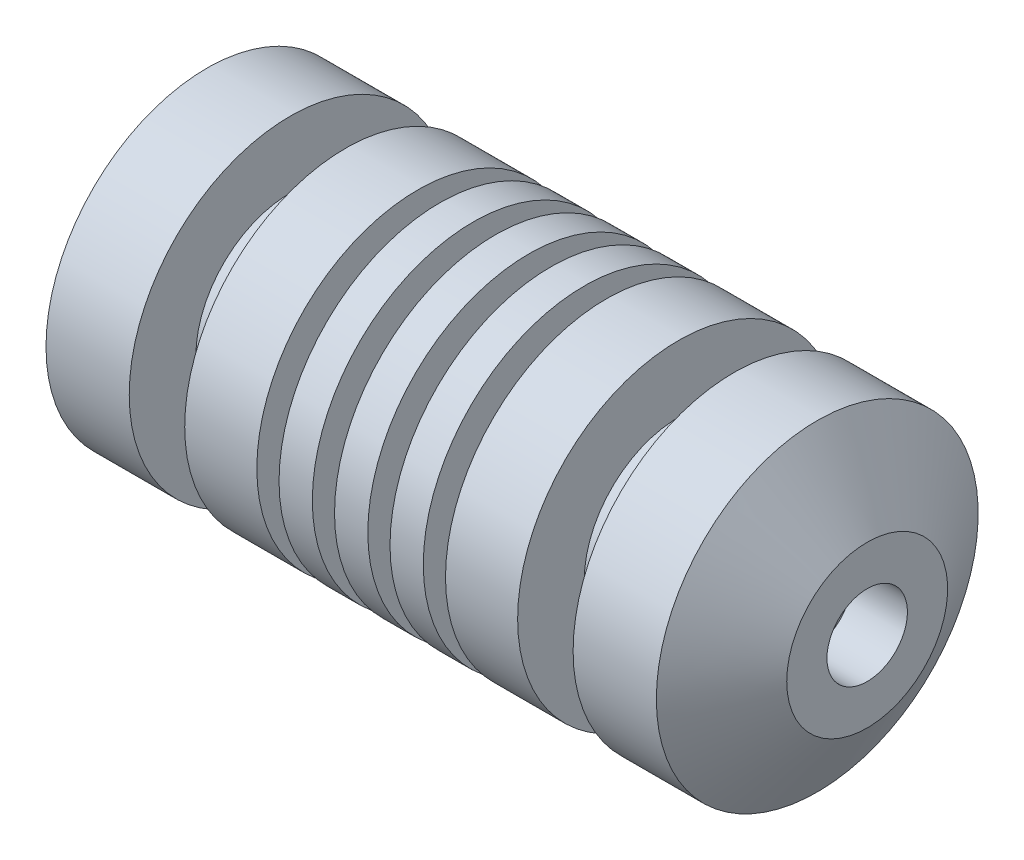
ISO-10303-21;
HEADER;
FILE_DESCRIPTION(('STEP AP214'),'2;1');
FILE_NAME('part.step','',(''),(''),'','','');
FILE_SCHEMA(('AUTOMOTIVE_DESIGN { 1 0 10303 214 1 1 1 1 }'));
ENDSEC;
DATA;
#1=APPLICATION_CONTEXT('core data for automotive mechanical design processes');
#2=APPLICATION_PROTOCOL_DEFINITION('international standard','automotive_design',2000,#1);
#3=PRODUCT_CONTEXT('',#1,'mechanical');
#4=PRODUCT('Part','Part','',(#3));
#5=PRODUCT_RELATED_PRODUCT_CATEGORY('part','',(#4));
#6=PRODUCT_DEFINITION_FORMATION('','',#4);
#7=PRODUCT_DEFINITION_CONTEXT('part definition',#1,'design');
#8=PRODUCT_DEFINITION('design','',#6,#7);
#9=PRODUCT_DEFINITION_SHAPE('','',#8);
#10=(LENGTH_UNIT() NAMED_UNIT(*) SI_UNIT(.MILLI.,.METRE.));
#11=(NAMED_UNIT(*) PLANE_ANGLE_UNIT() SI_UNIT($,.RADIAN.));
#12=(NAMED_UNIT(*) SI_UNIT($,.STERADIAN.) SOLID_ANGLE_UNIT());
#13=UNCERTAINTY_MEASURE_WITH_UNIT(LENGTH_MEASURE(1.E-05),#10,'distance_accuracy_value','');
#14=(GEOMETRIC_REPRESENTATION_CONTEXT(3) GLOBAL_UNCERTAINTY_ASSIGNED_CONTEXT((#13)) GLOBAL_UNIT_ASSIGNED_CONTEXT((#10,
#11,#12)) REPRESENTATION_CONTEXT('',''));
#15=CARTESIAN_POINT('',(0.,0.,0.));
#16=DIRECTION('',(0.,0.,1.));
#17=DIRECTION('',(1.,0.,0.));
#18=AXIS2_PLACEMENT_3D('',#15,#16,#17);
#19=CARTESIAN_POINT('',(0.,36.83,0.));
#20=DIRECTION('',(1.,0.,0.));
#21=DIRECTION('',(0.,0.,-1.));
#22=AXIS2_PLACEMENT_3D('',#19,#20,#21);
#23=PLANE('',#22);
#24=CARTESIAN_POINT('',(0.,0.,0.));
#25=DIRECTION('',(-1.,0.,0.));
#26=DIRECTION('',(0.,0.,1.));
#27=AXIS2_PLACEMENT_3D('',#24,#25,#26);
#28=CIRCLE('',#27,36.83);
#29=CARTESIAN_POINT('',(0.,0.,36.83));
#30=VERTEX_POINT('',#29);
#31=EDGE_CURVE('E168',#30,#30,#28,.T.);
#32=ORIENTED_EDGE('',*,*,#31,.T.);
#33=EDGE_LOOP('',(#32));
#34=FACE_BOUND('',#33,.T.);
#35=ADVANCED_FACE('F37',(#34),#23,.F.);
#36=CARTESIAN_POINT('',(0.,0.,0.));
#37=DIRECTION('',(-1.,0.,0.));
#38=DIRECTION('',(0.,0.,1.));
#39=AXIS2_PLACEMENT_3D('',#36,#37,#38);
#40=CYLINDRICAL_SURFACE('',#39,3.81);
#41=CARTESIAN_POINT('',(125.73,0.,0.));
#42=DIRECTION('',(-1.,0.,0.));
#43=DIRECTION('',(0.,0.,1.));
#44=AXIS2_PLACEMENT_3D('',#41,#42,#43);
#45=CIRCLE('',#44,3.81);
#46=CARTESIAN_POINT('',(125.73,0.,3.81));
#47=VERTEX_POINT('',#46);
#48=EDGE_CURVE('E10',#47,#47,#45,.T.);
#49=ORIENTED_EDGE('',*,*,#48,.F.);
#50=EDGE_LOOP('',(#49));
#51=FACE_BOUND('',#50,.T.);
#52=CARTESIAN_POINT('',(113.03,0.,0.));
#53=DIRECTION('',(1.,0.,0.));
#54=DIRECTION('',(0.,0.,-1.));
#55=AXIS2_PLACEMENT_3D('',#52,#53,#54);
#56=CIRCLE('',#55,3.81);
#57=CARTESIAN_POINT('',(113.03,0.,-3.81));
#58=VERTEX_POINT('',#57);
#59=EDGE_CURVE('E176',#58,#58,#56,.T.);
#60=ORIENTED_EDGE('',*,*,#59,.F.);
#61=EDGE_LOOP('',(#60));
#62=FACE_BOUND('',#61,.T.);
#63=ADVANCED_FACE('F183',(#51,#62),#40,.F.);
#64=CARTESIAN_POINT('',(125.73,6.35,0.));
#65=DIRECTION('',(-1.,0.,0.));
#66=DIRECTION('',(0.,0.,1.));
#67=AXIS2_PLACEMENT_3D('',#64,#65,#66);
#68=PLANE('',#67);
#69=CARTESIAN_POINT('',(125.73,0.,0.));
#70=DIRECTION('',(-1.,0.,0.));
#71=DIRECTION('',(0.,0.,1.));
#72=AXIS2_PLACEMENT_3D('',#69,#70,#71);
#73=CIRCLE('',#72,6.35);
#74=CARTESIAN_POINT('',(125.73,0.,6.35));
#75=VERTEX_POINT('',#74);
#76=EDGE_CURVE('E44',#75,#75,#73,.T.);
#77=ORIENTED_EDGE('',*,*,#76,.F.);
#78=EDGE_LOOP('',(#77));
#79=FACE_BOUND('',#78,.T.);
#80=ORIENTED_EDGE('',*,*,#48,.T.);
#81=EDGE_LOOP('',(#80));
#82=FACE_BOUND('',#81,.T.);
#83=ADVANCED_FACE('F185',(#79,#82),#68,.F.);
#84=CARTESIAN_POINT('',(0.,0.,0.));
#85=DIRECTION('',(-1.,0.,0.));
#86=DIRECTION('',(0.,0.,1.));
#87=AXIS2_PLACEMENT_3D('',#84,#85,#86);
#88=CYLINDRICAL_SURFACE('',#87,6.35);
#89=CARTESIAN_POINT('',(138.43,0.,0.));
#90=DIRECTION('',(-1.,0.,0.));
#91=DIRECTION('',(0.,0.,1.));
#92=AXIS2_PLACEMENT_3D('',#89,#90,#91);
#93=CIRCLE('',#92,6.35);
#94=CARTESIAN_POINT('',(138.43,0.,6.35));
#95=VERTEX_POINT('',#94);
#96=EDGE_CURVE('E49',#95,#95,#93,.T.);
#97=ORIENTED_EDGE('',*,*,#96,.F.);
#98=EDGE_LOOP('',(#97));
#99=FACE_BOUND('',#98,.T.);
#100=ORIENTED_EDGE('',*,*,#76,.T.);
#101=EDGE_LOOP('',(#100));
#102=FACE_BOUND('',#101,.T.);
#103=ADVANCED_FACE('F191',(#99,#102),#88,.F.);
#104=CARTESIAN_POINT('',(138.43,9.2075,0.));
#105=DIRECTION('',(-1.,0.,0.));
#106=DIRECTION('',(0.,0.,1.));
#107=AXIS2_PLACEMENT_3D('',#104,#105,#106);
#108=PLANE('',#107);
#109=CARTESIAN_POINT('',(138.43,0.,0.));
#110=DIRECTION('',(-1.,0.,0.));
#111=DIRECTION('',(0.,0.,1.));
#112=AXIS2_PLACEMENT_3D('',#109,#110,#111);
#113=CIRCLE('',#112,9.2075);
#114=CARTESIAN_POINT('',(138.43,0.,9.2075));
#115=VERTEX_POINT('',#114);
#116=EDGE_CURVE('E54',#115,#115,#113,.T.);
#117=ORIENTED_EDGE('',*,*,#116,.F.);
#118=EDGE_LOOP('',(#117));
#119=FACE_BOUND('',#118,.T.);
#120=ORIENTED_EDGE('',*,*,#96,.T.);
#121=EDGE_LOOP('',(#120));
#122=FACE_BOUND('',#121,.T.);
#123=ADVANCED_FACE('F198',(#119,#122),#108,.F.);
#124=CARTESIAN_POINT('',(0.,0.,0.));
#125=DIRECTION('',(-1.,0.,0.));
#126=DIRECTION('',(0.,0.,1.));
#127=AXIS2_PLACEMENT_3D('',#124,#125,#126);
#128=CYLINDRICAL_SURFACE('',#127,9.2075);
#129=CARTESIAN_POINT('',(151.13,0.,0.));
#130=DIRECTION('',(-1.,0.,0.));
#131=DIRECTION('',(0.,0.,1.));
#132=AXIS2_PLACEMENT_3D('',#129,#130,#131);
#133=CIRCLE('',#132,9.2075);
#134=CARTESIAN_POINT('',(151.13,0.,9.2075));
#135=VERTEX_POINT('',#134);
#136=EDGE_CURVE('E60',#135,#135,#133,.T.);
#137=ORIENTED_EDGE('',*,*,#136,.F.);
#138=EDGE_LOOP('',(#137));
#139=FACE_BOUND('',#138,.T.);
#140=ORIENTED_EDGE('',*,*,#116,.T.);
#141=EDGE_LOOP('',(#140));
#142=FACE_BOUND('',#141,.T.);
#143=ADVANCED_FACE('F202',(#139,#142),#128,.F.);
#144=CARTESIAN_POINT('',(151.13,18.415,0.));
#145=DIRECTION('',(-1.,0.,0.));
#146=DIRECTION('',(0.,0.,1.));
#147=AXIS2_PLACEMENT_3D('',#144,#145,#146);
#148=PLANE('',#147);
#149=CARTESIAN_POINT('',(151.13,0.,0.));
#150=DIRECTION('',(-1.,0.,0.));
#151=DIRECTION('',(0.,0.,1.));
#152=AXIS2_PLACEMENT_3D('',#149,#150,#151);
#153=CIRCLE('',#152,18.415);
#154=CARTESIAN_POINT('',(151.13,0.,18.415));
#155=VERTEX_POINT('',#154);
#156=EDGE_CURVE('E64',#155,#155,#153,.T.);
#157=ORIENTED_EDGE('',*,*,#156,.F.);
#158=EDGE_LOOP('',(#157));
#159=FACE_BOUND('',#158,.T.);
#160=ORIENTED_EDGE('',*,*,#136,.T.);
#161=EDGE_LOOP('',(#160));
#162=FACE_BOUND('',#161,.T.);
#163=ADVANCED_FACE('F206',(#159,#162),#148,.F.);
#164=CARTESIAN_POINT('',(151.13,0.,0.));
#165=DIRECTION('',(-1.,0.,0.));
#166=DIRECTION('',(0.,0.,1.));
#167=AXIS2_PLACEMENT_3D('',#164,#165,#166);
#168=CONICAL_SURFACE('',#167,18.415,1.01530287600629);
#169=CARTESIAN_POINT('',(139.700007256858,0.,0.));
#170=DIRECTION('',(-1.,0.,0.));
#171=DIRECTION('',(0.,0.,1.));
#172=AXIS2_PLACEMENT_3D('',#169,#170,#171);
#173=CIRCLE('',#172,36.83);
#174=CARTESIAN_POINT('',(139.700007256858,0.,36.83));
#175=VERTEX_POINT('',#174);
#176=EDGE_CURVE('E68',#175,#175,#173,.T.);
#177=ORIENTED_EDGE('',*,*,#176,.F.);
#178=EDGE_LOOP('',(#177));
#179=FACE_BOUND('',#178,.T.);
#180=ORIENTED_EDGE('',*,*,#156,.T.);
#181=EDGE_LOOP('',(#180));
#182=FACE_BOUND('',#181,.T.);
#183=ADVANCED_FACE('F210',(#179,#182),#168,.T.);
#184=CARTESIAN_POINT('',(0.,0.,0.));
#185=DIRECTION('',(-1.,0.,0.));
#186=DIRECTION('',(0.,0.,1.));
#187=AXIS2_PLACEMENT_3D('',#184,#185,#186);
#188=CYLINDRICAL_SURFACE('',#187,36.83);
#189=CARTESIAN_POINT('',(120.650007256858,0.,0.));
#190=DIRECTION('',(-1.,0.,0.));
#191=DIRECTION('',(0.,0.,1.));
#192=AXIS2_PLACEMENT_3D('',#189,#190,#191);
#193=CIRCLE('',#192,36.83);
#194=CARTESIAN_POINT('',(120.650007256858,0.,36.83));
#195=VERTEX_POINT('',#194);
#196=EDGE_CURVE('E72',#195,#195,#193,.T.);
#197=ORIENTED_EDGE('',*,*,#196,.F.);
#198=EDGE_LOOP('',(#197));
#199=FACE_BOUND('',#198,.T.);
#200=ORIENTED_EDGE('',*,*,#176,.T.);
#201=EDGE_LOOP('',(#200));
#202=FACE_BOUND('',#201,.T.);
#203=ADVANCED_FACE('F214',(#199,#202),#188,.T.);
#204=CARTESIAN_POINT('',(120.650007256858,36.83,0.));
#205=DIRECTION('',(1.,0.,0.));
#206=DIRECTION('',(0.,0.,-1.));
#207=AXIS2_PLACEMENT_3D('',#204,#205,#206);
#208=PLANE('',#207);
#209=CARTESIAN_POINT('',(120.650007256858,0.,0.));
#210=DIRECTION('',(-1.,0.,0.));
#211=DIRECTION('',(0.,0.,1.));
#212=AXIS2_PLACEMENT_3D('',#209,#210,#211);
#213=CIRCLE('',#212,21.5899999999998);
#214=CARTESIAN_POINT('',(120.650007256858,0.,21.5899999999998));
#215=VERTEX_POINT('',#214);
#216=EDGE_CURVE('E76',#215,#215,#213,.T.);
#217=ORIENTED_EDGE('',*,*,#216,.F.);
#218=EDGE_LOOP('',(#217));
#219=FACE_BOUND('',#218,.T.);
#220=ORIENTED_EDGE('',*,*,#196,.T.);
#221=EDGE_LOOP('',(#220));
#222=FACE_BOUND('',#221,.T.);
#223=ADVANCED_FACE('F218',(#219,#222),#208,.F.);
#224=CARTESIAN_POINT('',(0.,0.,0.));
#225=DIRECTION('',(-1.,0.,0.));
#226=DIRECTION('',(0.,0.,1.));
#227=AXIS2_PLACEMENT_3D('',#224,#225,#226);
#228=CYLINDRICAL_SURFACE('',#227,21.5899999999998);
#229=CARTESIAN_POINT('',(107.950007256858,0.,0.));
#230=DIRECTION('',(-1.,0.,0.));
#231=DIRECTION('',(0.,0.,1.));
#232=AXIS2_PLACEMENT_3D('',#229,#230,#231);
#233=CIRCLE('',#232,21.5899999999998);
#234=CARTESIAN_POINT('',(107.950007256858,0.,21.5899999999998));
#235=VERTEX_POINT('',#234);
#236=EDGE_CURVE('E80',#235,#235,#233,.T.);
#237=ORIENTED_EDGE('',*,*,#236,.F.);
#238=EDGE_LOOP('',(#237));
#239=FACE_BOUND('',#238,.T.);
#240=ORIENTED_EDGE('',*,*,#216,.T.);
#241=EDGE_LOOP('',(#240));
#242=FACE_BOUND('',#241,.T.);
#243=ADVANCED_FACE('F222',(#239,#242),#228,.T.);
#244=CARTESIAN_POINT('',(107.950007256858,36.83,0.));
#245=DIRECTION('',(-1.,0.,0.));
#246=DIRECTION('',(0.,0.,1.));
#247=AXIS2_PLACEMENT_3D('',#244,#245,#246);
#248=PLANE('',#247);
#249=CARTESIAN_POINT('',(107.950007256858,0.,0.));
#250=DIRECTION('',(-1.,0.,0.));
#251=DIRECTION('',(0.,0.,1.));
#252=AXIS2_PLACEMENT_3D('',#249,#250,#251);
#253=CIRCLE('',#252,36.83);
#254=CARTESIAN_POINT('',(107.950007256858,0.,36.83));
#255=VERTEX_POINT('',#254);
#256=EDGE_CURVE('E84',#255,#255,#253,.T.);
#257=ORIENTED_EDGE('',*,*,#256,.F.);
#258=EDGE_LOOP('',(#257));
#259=FACE_BOUND('',#258,.T.);
#260=ORIENTED_EDGE('',*,*,#236,.T.);
#261=EDGE_LOOP('',(#260));
#262=FACE_BOUND('',#261,.T.);
#263=ADVANCED_FACE('F226',(#259,#262),#248,.F.);
#264=CARTESIAN_POINT('',(0.,0.,0.));
#265=DIRECTION('',(-1.,0.,0.));
#266=DIRECTION('',(0.,0.,1.));
#267=AXIS2_PLACEMENT_3D('',#264,#265,#266);
#268=CYLINDRICAL_SURFACE('',#267,36.83);
#269=CARTESIAN_POINT('',(91.4400072568583,0.,0.));
#270=DIRECTION('',(-1.,0.,0.));
#271=DIRECTION('',(0.,0.,1.));
#272=AXIS2_PLACEMENT_3D('',#269,#270,#271);
#273=CIRCLE('',#272,36.83);
#274=CARTESIAN_POINT('',(91.4400072568583,0.,36.83));
#275=VERTEX_POINT('',#274);
#276=EDGE_CURVE('E88',#275,#275,#273,.T.);
#277=ORIENTED_EDGE('',*,*,#276,.F.);
#278=EDGE_LOOP('',(#277));
#279=FACE_BOUND('',#278,.T.);
#280=ORIENTED_EDGE('',*,*,#256,.T.);
#281=EDGE_LOOP('',(#280));
#282=FACE_BOUND('',#281,.T.);
#283=ADVANCED_FACE('F230',(#279,#282),#268,.T.);
#284=CARTESIAN_POINT('',(91.4400072568583,36.83,0.));
#285=DIRECTION('',(1.,0.,0.));
#286=DIRECTION('',(0.,0.,-1.));
#287=AXIS2_PLACEMENT_3D('',#284,#285,#286);
#288=PLANE('',#287);
#289=CARTESIAN_POINT('',(91.4400072568583,0.,0.));
#290=DIRECTION('',(-1.,0.,0.));
#291=DIRECTION('',(0.,0.,1.));
#292=AXIS2_PLACEMENT_3D('',#289,#290,#291);
#293=CIRCLE('',#292,29.21);
#294=CARTESIAN_POINT('',(91.4400072568583,0.,29.21));
#295=VERTEX_POINT('',#294);
#296=EDGE_CURVE('E92',#295,#295,#293,.T.);
#297=ORIENTED_EDGE('',*,*,#296,.F.);
#298=EDGE_LOOP('',(#297));
#299=FACE_BOUND('',#298,.T.);
#300=ORIENTED_EDGE('',*,*,#276,.T.);
#301=EDGE_LOOP('',(#300));
#302=FACE_BOUND('',#301,.T.);
#303=ADVANCED_FACE('F234',(#299,#302),#288,.F.);
#304=CARTESIAN_POINT('',(0.,0.,0.));
#305=DIRECTION('',(-1.,0.,0.));
#306=DIRECTION('',(0.,0.,1.));
#307=AXIS2_PLACEMENT_3D('',#304,#305,#306);
#308=CYLINDRICAL_SURFACE('',#307,29.21);
#309=CARTESIAN_POINT('',(86.3600072568583,0.,0.));
#310=DIRECTION('',(-1.,0.,0.));
#311=DIRECTION('',(0.,0.,1.));
#312=AXIS2_PLACEMENT_3D('',#309,#310,#311);
#313=CIRCLE('',#312,29.21);
#314=CARTESIAN_POINT('',(86.3600072568583,0.,29.21));
#315=VERTEX_POINT('',#314);
#316=EDGE_CURVE('E96',#315,#315,#313,.T.);
#317=ORIENTED_EDGE('',*,*,#316,.F.);
#318=EDGE_LOOP('',(#317));
#319=FACE_BOUND('',#318,.T.);
#320=ORIENTED_EDGE('',*,*,#296,.T.);
#321=EDGE_LOOP('',(#320));
#322=FACE_BOUND('',#321,.T.);
#323=ADVANCED_FACE('F238',(#319,#322),#308,.T.);
#324=CARTESIAN_POINT('',(86.3600072568583,36.83,0.));
#325=DIRECTION('',(-1.,0.,0.));
#326=DIRECTION('',(0.,0.,1.));
#327=AXIS2_PLACEMENT_3D('',#324,#325,#326);
#328=PLANE('',#327);
#329=CARTESIAN_POINT('',(86.3600072568583,0.,0.));
#330=DIRECTION('',(-1.,0.,0.));
#331=DIRECTION('',(0.,0.,1.));
#332=AXIS2_PLACEMENT_3D('',#329,#330,#331);
#333=CIRCLE('',#332,36.83);
#334=CARTESIAN_POINT('',(86.3600072568583,0.,36.83));
#335=VERTEX_POINT('',#334);
#336=EDGE_CURVE('E100',#335,#335,#333,.T.);
#337=ORIENTED_EDGE('',*,*,#336,.F.);
#338=EDGE_LOOP('',(#337));
#339=FACE_BOUND('',#338,.T.);
#340=ORIENTED_EDGE('',*,*,#316,.T.);
#341=EDGE_LOOP('',(#340));
#342=FACE_BOUND('',#341,.T.);
#343=ADVANCED_FACE('F242',(#339,#342),#328,.F.);
#344=CARTESIAN_POINT('',(0.,0.,0.));
#345=DIRECTION('',(-1.,0.,0.));
#346=DIRECTION('',(0.,0.,1.));
#347=AXIS2_PLACEMENT_3D('',#344,#345,#346);
#348=CYLINDRICAL_SURFACE('',#347,36.83);
#349=CARTESIAN_POINT('',(78.7400072568583,0.,0.));
#350=DIRECTION('',(-1.,0.,0.));
#351=DIRECTION('',(0.,0.,1.));
#352=AXIS2_PLACEMENT_3D('',#349,#350,#351);
#353=CIRCLE('',#352,36.83);
#354=CARTESIAN_POINT('',(78.7400072568583,0.,36.83));
#355=VERTEX_POINT('',#354);
#356=EDGE_CURVE('E104',#355,#355,#353,.T.);
#357=ORIENTED_EDGE('',*,*,#356,.F.);
#358=EDGE_LOOP('',(#357));
#359=FACE_BOUND('',#358,.T.);
#360=ORIENTED_EDGE('',*,*,#336,.T.);
#361=EDGE_LOOP('',(#360));
#362=FACE_BOUND('',#361,.T.);
#363=ADVANCED_FACE('F246',(#359,#362),#348,.T.);
#364=CARTESIAN_POINT('',(78.7400072568583,36.83,0.));
#365=DIRECTION('',(1.,0.,0.));
#366=DIRECTION('',(0.,0.,-1.));
#367=AXIS2_PLACEMENT_3D('',#364,#365,#366);
#368=PLANE('',#367);
#369=CARTESIAN_POINT('',(78.7400072568583,0.,0.));
#370=DIRECTION('',(-1.,0.,0.));
#371=DIRECTION('',(0.,0.,1.));
#372=AXIS2_PLACEMENT_3D('',#369,#370,#371);
#373=CIRCLE('',#372,29.21);
#374=CARTESIAN_POINT('',(78.7400072568583,0.,29.21));
#375=VERTEX_POINT('',#374);
#376=EDGE_CURVE('E108',#375,#375,#373,.T.);
#377=ORIENTED_EDGE('',*,*,#376,.F.);
#378=EDGE_LOOP('',(#377));
#379=FACE_BOUND('',#378,.T.);
#380=ORIENTED_EDGE('',*,*,#356,.T.);
#381=EDGE_LOOP('',(#380));
#382=FACE_BOUND('',#381,.T.);
#383=ADVANCED_FACE('F250',(#379,#382),#368,.F.);
#384=CARTESIAN_POINT('',(0.,0.,0.));
#385=DIRECTION('',(-1.,0.,0.));
#386=DIRECTION('',(0.,0.,1.));
#387=AXIS2_PLACEMENT_3D('',#384,#385,#386);
#388=CYLINDRICAL_SURFACE('',#387,29.21);
#389=CARTESIAN_POINT('',(73.6600072568583,0.,0.));
#390=DIRECTION('',(-1.,0.,0.));
#391=DIRECTION('',(0.,0.,1.));
#392=AXIS2_PLACEMENT_3D('',#389,#390,#391);
#393=CIRCLE('',#392,29.21);
#394=CARTESIAN_POINT('',(73.6600072568583,0.,29.21));
#395=VERTEX_POINT('',#394);
#396=EDGE_CURVE('E112',#395,#395,#393,.T.);
#397=ORIENTED_EDGE('',*,*,#396,.F.);
#398=EDGE_LOOP('',(#397));
#399=FACE_BOUND('',#398,.T.);
#400=ORIENTED_EDGE('',*,*,#376,.T.);
#401=EDGE_LOOP('',(#400));
#402=FACE_BOUND('',#401,.T.);
#403=ADVANCED_FACE('F254',(#399,#402),#388,.T.);
#404=CARTESIAN_POINT('',(73.6600072568583,36.83,0.));
#405=DIRECTION('',(-1.,0.,0.));
#406=DIRECTION('',(0.,0.,1.));
#407=AXIS2_PLACEMENT_3D('',#404,#405,#406);
#408=PLANE('',#407);
#409=CARTESIAN_POINT('',(73.6600072568583,0.,0.));
#410=DIRECTION('',(-1.,0.,0.));
#411=DIRECTION('',(0.,0.,1.));
#412=AXIS2_PLACEMENT_3D('',#409,#410,#411);
#413=CIRCLE('',#412,36.83);
#414=CARTESIAN_POINT('',(73.6600072568583,0.,36.83));
#415=VERTEX_POINT('',#414);
#416=EDGE_CURVE('E116',#415,#415,#413,.T.);
#417=ORIENTED_EDGE('',*,*,#416,.F.);
#418=EDGE_LOOP('',(#417));
#419=FACE_BOUND('',#418,.T.);
#420=ORIENTED_EDGE('',*,*,#396,.T.);
#421=EDGE_LOOP('',(#420));
#422=FACE_BOUND('',#421,.T.);
#423=ADVANCED_FACE('F258',(#419,#422),#408,.F.);
#424=CARTESIAN_POINT('',(0.,0.,0.));
#425=DIRECTION('',(-1.,0.,0.));
#426=DIRECTION('',(0.,0.,1.));
#427=AXIS2_PLACEMENT_3D('',#424,#425,#426);
#428=CYLINDRICAL_SURFACE('',#427,36.83);
#429=CARTESIAN_POINT('',(66.0400072568583,0.,0.));
#430=DIRECTION('',(-1.,0.,0.));
#431=DIRECTION('',(0.,0.,1.));
#432=AXIS2_PLACEMENT_3D('',#429,#430,#431);
#433=CIRCLE('',#432,36.83);
#434=CARTESIAN_POINT('',(66.0400072568583,0.,36.83));
#435=VERTEX_POINT('',#434);
#436=EDGE_CURVE('E120',#435,#435,#433,.T.);
#437=ORIENTED_EDGE('',*,*,#436,.F.);
#438=EDGE_LOOP('',(#437));
#439=FACE_BOUND('',#438,.T.);
#440=ORIENTED_EDGE('',*,*,#416,.T.);
#441=EDGE_LOOP('',(#440));
#442=FACE_BOUND('',#441,.T.);
#443=ADVANCED_FACE('F262',(#439,#442),#428,.T.);
#444=CARTESIAN_POINT('',(66.0400072568583,36.83,0.));
#445=DIRECTION('',(1.,0.,0.));
#446=DIRECTION('',(0.,0.,-1.));
#447=AXIS2_PLACEMENT_3D('',#444,#445,#446);
#448=PLANE('',#447);
#449=CARTESIAN_POINT('',(66.0400072568583,0.,0.));
#450=DIRECTION('',(-1.,0.,0.));
#451=DIRECTION('',(0.,0.,1.));
#452=AXIS2_PLACEMENT_3D('',#449,#450,#451);
#453=CIRCLE('',#452,29.21);
#454=CARTESIAN_POINT('',(66.0400072568583,0.,29.21));
#455=VERTEX_POINT('',#454);
#456=EDGE_CURVE('E124',#455,#455,#453,.T.);
#457=ORIENTED_EDGE('',*,*,#456,.F.);
#458=EDGE_LOOP('',(#457));
#459=FACE_BOUND('',#458,.T.);
#460=ORIENTED_EDGE('',*,*,#436,.T.);
#461=EDGE_LOOP('',(#460));
#462=FACE_BOUND('',#461,.T.);
#463=ADVANCED_FACE('F266',(#459,#462),#448,.F.);
#464=CARTESIAN_POINT('',(0.,0.,0.));
#465=DIRECTION('',(-1.,0.,0.));
#466=DIRECTION('',(0.,0.,1.));
#467=AXIS2_PLACEMENT_3D('',#464,#465,#466);
#468=CYLINDRICAL_SURFACE('',#467,29.21);
#469=CARTESIAN_POINT('',(60.9600072568583,0.,0.));
#470=DIRECTION('',(-1.,0.,0.));
#471=DIRECTION('',(0.,0.,1.));
#472=AXIS2_PLACEMENT_3D('',#469,#470,#471);
#473=CIRCLE('',#472,29.21);
#474=CARTESIAN_POINT('',(60.9600072568583,0.,29.21));
#475=VERTEX_POINT('',#474);
#476=EDGE_CURVE('E128',#475,#475,#473,.T.);
#477=ORIENTED_EDGE('',*,*,#476,.F.);
#478=EDGE_LOOP('',(#477));
#479=FACE_BOUND('',#478,.T.);
#480=ORIENTED_EDGE('',*,*,#456,.T.);
#481=EDGE_LOOP('',(#480));
#482=FACE_BOUND('',#481,.T.);
#483=ADVANCED_FACE('F270',(#479,#482),#468,.T.);
#484=CARTESIAN_POINT('',(60.9600072568583,36.83,0.));
#485=DIRECTION('',(-1.,0.,0.));
#486=DIRECTION('',(0.,0.,1.));
#487=AXIS2_PLACEMENT_3D('',#484,#485,#486);
#488=PLANE('',#487);
#489=CARTESIAN_POINT('',(60.9600072568583,0.,0.));
#490=DIRECTION('',(-1.,0.,0.));
#491=DIRECTION('',(0.,0.,1.));
#492=AXIS2_PLACEMENT_3D('',#489,#490,#491);
#493=CIRCLE('',#492,36.83);
#494=CARTESIAN_POINT('',(60.9600072568583,0.,36.83));
#495=VERTEX_POINT('',#494);
#496=EDGE_CURVE('E132',#495,#495,#493,.T.);
#497=ORIENTED_EDGE('',*,*,#496,.F.);
#498=EDGE_LOOP('',(#497));
#499=FACE_BOUND('',#498,.T.);
#500=ORIENTED_EDGE('',*,*,#476,.T.);
#501=EDGE_LOOP('',(#500));
#502=FACE_BOUND('',#501,.T.);
#503=ADVANCED_FACE('F274',(#499,#502),#488,.F.);
#504=CARTESIAN_POINT('',(0.,0.,0.));
#505=DIRECTION('',(-1.,0.,0.));
#506=DIRECTION('',(0.,0.,1.));
#507=AXIS2_PLACEMENT_3D('',#504,#505,#506);
#508=CYLINDRICAL_SURFACE('',#507,36.83);
#509=CARTESIAN_POINT('',(53.3400072568583,0.,0.));
#510=DIRECTION('',(-1.,0.,0.));
#511=DIRECTION('',(0.,0.,1.));
#512=AXIS2_PLACEMENT_3D('',#509,#510,#511);
#513=CIRCLE('',#512,36.83);
#514=CARTESIAN_POINT('',(53.3400072568583,0.,36.83));
#515=VERTEX_POINT('',#514);
#516=EDGE_CURVE('E136',#515,#515,#513,.T.);
#517=ORIENTED_EDGE('',*,*,#516,.F.);
#518=EDGE_LOOP('',(#517));
#519=FACE_BOUND('',#518,.T.);
#520=ORIENTED_EDGE('',*,*,#496,.T.);
#521=EDGE_LOOP('',(#520));
#522=FACE_BOUND('',#521,.T.);
#523=ADVANCED_FACE('F278',(#519,#522),#508,.T.);
#524=CARTESIAN_POINT('',(53.3400072568583,36.83,0.));
#525=DIRECTION('',(1.,0.,0.));
#526=DIRECTION('',(0.,0.,-1.));
#527=AXIS2_PLACEMENT_3D('',#524,#525,#526);
#528=PLANE('',#527);
#529=CARTESIAN_POINT('',(53.3400072568583,0.,0.));
#530=DIRECTION('',(-1.,0.,0.));
#531=DIRECTION('',(0.,0.,1.));
#532=AXIS2_PLACEMENT_3D('',#529,#530,#531);
#533=CIRCLE('',#532,29.21);
#534=CARTESIAN_POINT('',(53.3400072568583,0.,29.21));
#535=VERTEX_POINT('',#534);
#536=EDGE_CURVE('E140',#535,#535,#533,.T.);
#537=ORIENTED_EDGE('',*,*,#536,.F.);
#538=EDGE_LOOP('',(#537));
#539=FACE_BOUND('',#538,.T.);
#540=ORIENTED_EDGE('',*,*,#516,.T.);
#541=EDGE_LOOP('',(#540));
#542=FACE_BOUND('',#541,.T.);
#543=ADVANCED_FACE('F282',(#539,#542),#528,.F.);
#544=CARTESIAN_POINT('',(0.,0.,0.));
#545=DIRECTION('',(-1.,0.,0.));
#546=DIRECTION('',(0.,0.,1.));
#547=AXIS2_PLACEMENT_3D('',#544,#545,#546);
#548=CYLINDRICAL_SURFACE('',#547,29.21);
#549=CARTESIAN_POINT('',(48.2600072568583,0.,0.));
#550=DIRECTION('',(-1.,0.,0.));
#551=DIRECTION('',(0.,0.,1.));
#552=AXIS2_PLACEMENT_3D('',#549,#550,#551);
#553=CIRCLE('',#552,29.21);
#554=CARTESIAN_POINT('',(48.2600072568583,0.,29.21));
#555=VERTEX_POINT('',#554);
#556=EDGE_CURVE('E144',#555,#555,#553,.T.);
#557=ORIENTED_EDGE('',*,*,#556,.F.);
#558=EDGE_LOOP('',(#557));
#559=FACE_BOUND('',#558,.T.);
#560=ORIENTED_EDGE('',*,*,#536,.T.);
#561=EDGE_LOOP('',(#560));
#562=FACE_BOUND('',#561,.T.);
#563=ADVANCED_FACE('F286',(#559,#562),#548,.T.);
#564=CARTESIAN_POINT('',(48.2600072568583,36.83,0.));
#565=DIRECTION('',(-1.,0.,0.));
#566=DIRECTION('',(0.,0.,1.));
#567=AXIS2_PLACEMENT_3D('',#564,#565,#566);
#568=PLANE('',#567);
#569=CARTESIAN_POINT('',(48.2600072568583,0.,0.));
#570=DIRECTION('',(-1.,0.,0.));
#571=DIRECTION('',(0.,0.,1.));
#572=AXIS2_PLACEMENT_3D('',#569,#570,#571);
#573=CIRCLE('',#572,36.83);
#574=CARTESIAN_POINT('',(48.2600072568583,0.,36.83));
#575=VERTEX_POINT('',#574);
#576=EDGE_CURVE('E148',#575,#575,#573,.T.);
#577=ORIENTED_EDGE('',*,*,#576,.F.);
#578=EDGE_LOOP('',(#577));
#579=FACE_BOUND('',#578,.T.);
#580=ORIENTED_EDGE('',*,*,#556,.T.);
#581=EDGE_LOOP('',(#580));
#582=FACE_BOUND('',#581,.T.);
#583=ADVANCED_FACE('F290',(#579,#582),#568,.F.);
#584=CARTESIAN_POINT('',(0.,0.,0.));
#585=DIRECTION('',(-1.,0.,0.));
#586=DIRECTION('',(0.,0.,1.));
#587=AXIS2_PLACEMENT_3D('',#584,#585,#586);
#588=CYLINDRICAL_SURFACE('',#587,36.83);
#589=CARTESIAN_POINT('',(31.7500072568583,0.,0.));
#590=DIRECTION('',(-1.,0.,0.));
#591=DIRECTION('',(0.,0.,1.));
#592=AXIS2_PLACEMENT_3D('',#589,#590,#591);
#593=CIRCLE('',#592,36.83);
#594=CARTESIAN_POINT('',(31.7500072568583,0.,36.83));
#595=VERTEX_POINT('',#594);
#596=EDGE_CURVE('E152',#595,#595,#593,.T.);
#597=ORIENTED_EDGE('',*,*,#596,.F.);
#598=EDGE_LOOP('',(#597));
#599=FACE_BOUND('',#598,.T.);
#600=ORIENTED_EDGE('',*,*,#576,.T.);
#601=EDGE_LOOP('',(#600));
#602=FACE_BOUND('',#601,.T.);
#603=ADVANCED_FACE('F294',(#599,#602),#588,.T.);
#604=CARTESIAN_POINT('',(31.7500072568583,36.83,0.));
#605=DIRECTION('',(1.,0.,0.));
#606=DIRECTION('',(0.,0.,-1.));
#607=AXIS2_PLACEMENT_3D('',#604,#605,#606);
#608=PLANE('',#607);
#609=CARTESIAN_POINT('',(31.7500072568583,0.,0.));
#610=DIRECTION('',(-1.,0.,0.));
#611=DIRECTION('',(0.,0.,1.));
#612=AXIS2_PLACEMENT_3D('',#609,#610,#611);
#613=CIRCLE('',#612,21.5899999999998);
#614=CARTESIAN_POINT('',(31.7500072568583,0.,21.5899999999998));
#615=VERTEX_POINT('',#614);
#616=EDGE_CURVE('E156',#615,#615,#613,.T.);
#617=ORIENTED_EDGE('',*,*,#616,.F.);
#618=EDGE_LOOP('',(#617));
#619=FACE_BOUND('',#618,.T.);
#620=ORIENTED_EDGE('',*,*,#596,.T.);
#621=EDGE_LOOP('',(#620));
#622=FACE_BOUND('',#621,.T.);
#623=ADVANCED_FACE('F298',(#619,#622),#608,.F.);
#624=CARTESIAN_POINT('',(0.,0.,0.));
#625=DIRECTION('',(-1.,0.,0.));
#626=DIRECTION('',(0.,0.,1.));
#627=AXIS2_PLACEMENT_3D('',#624,#625,#626);
#628=CYLINDRICAL_SURFACE('',#627,21.5899999999998);
#629=CARTESIAN_POINT('',(19.0500072568583,0.,0.));
#630=DIRECTION('',(-1.,0.,0.));
#631=DIRECTION('',(0.,0.,1.));
#632=AXIS2_PLACEMENT_3D('',#629,#630,#631);
#633=CIRCLE('',#632,21.5899999999998);
#634=CARTESIAN_POINT('',(19.0500072568583,0.,21.5899999999998));
#635=VERTEX_POINT('',#634);
#636=EDGE_CURVE('E160',#635,#635,#633,.T.);
#637=ORIENTED_EDGE('',*,*,#636,.F.);
#638=EDGE_LOOP('',(#637));
#639=FACE_BOUND('',#638,.T.);
#640=ORIENTED_EDGE('',*,*,#616,.T.);
#641=EDGE_LOOP('',(#640));
#642=FACE_BOUND('',#641,.T.);
#643=ADVANCED_FACE('F302',(#639,#642),#628,.T.);
#644=CARTESIAN_POINT('',(19.0500072568583,36.83,0.));
#645=DIRECTION('',(-1.,0.,0.));
#646=DIRECTION('',(0.,0.,1.));
#647=AXIS2_PLACEMENT_3D('',#644,#645,#646);
#648=PLANE('',#647);
#649=CARTESIAN_POINT('',(19.0500072568583,0.,0.));
#650=DIRECTION('',(-1.,0.,0.));
#651=DIRECTION('',(0.,0.,1.));
#652=AXIS2_PLACEMENT_3D('',#649,#650,#651);
#653=CIRCLE('',#652,36.83);
#654=CARTESIAN_POINT('',(19.0500072568583,0.,36.83));
#655=VERTEX_POINT('',#654);
#656=EDGE_CURVE('E164',#655,#655,#653,.T.);
#657=ORIENTED_EDGE('',*,*,#656,.F.);
#658=EDGE_LOOP('',(#657));
#659=FACE_BOUND('',#658,.T.);
#660=ORIENTED_EDGE('',*,*,#636,.T.);
#661=EDGE_LOOP('',(#660));
#662=FACE_BOUND('',#661,.T.);
#663=ADVANCED_FACE('F306',(#659,#662),#648,.F.);
#664=CARTESIAN_POINT('',(0.,0.,0.));
#665=DIRECTION('',(-1.,0.,0.));
#666=DIRECTION('',(0.,0.,1.));
#667=AXIS2_PLACEMENT_3D('',#664,#665,#666);
#668=CYLINDRICAL_SURFACE('',#667,36.83);
#669=ORIENTED_EDGE('',*,*,#31,.F.);
#670=EDGE_LOOP('',(#669));
#671=FACE_BOUND('',#670,.T.);
#672=ORIENTED_EDGE('',*,*,#656,.T.);
#673=EDGE_LOOP('',(#672));
#674=FACE_BOUND('',#673,.T.);
#675=ADVANCED_FACE('F310',(#671,#674),#668,.T.);
#676=CARTESIAN_POINT('',(113.03,0.,0.));
#677=DIRECTION('',(1.,0.,0.));
#678=DIRECTION('',(0.,0.,-1.));
#679=AXIS2_PLACEMENT_3D('',#676,#677,#678);
#680=CONICAL_SURFACE('',#679,3.81,0.977384381116825);
#681=CARTESIAN_POINT('',(110.49,0.,0.));
#682=DIRECTION('',(1.,0.,0.));
#683=DIRECTION('',(0.,0.,-1.));
#684=AXIS2_PLACEMENT_3D('',#681,#682,#683);
#685=CIRCLE('',#684,0.0442951399776285);
#686=CARTESIAN_POINT('',(110.49,0.,-0.0442951399776285));
#687=VERTEX_POINT('',#686);
#688=EDGE_CURVE('E172',#687,#687,#685,.T.);
#689=ORIENTED_EDGE('',*,*,#688,.F.);
#690=EDGE_LOOP('',(#689));
#691=FACE_BOUND('',#690,.T.);
#692=ORIENTED_EDGE('',*,*,#59,.T.);
#693=EDGE_LOOP('',(#692));
#694=FACE_BOUND('',#693,.T.);
#695=ADVANCED_FACE('F181',(#691,#694),#680,.F.);
#696=CARTESIAN_POINT('',(110.49,0.,0.));
#697=DIRECTION('',(1.,0.,0.));
#698=DIRECTION('',(0.,0.,-1.));
#699=AXIS2_PLACEMENT_3D('',#696,#697,#698);
#700=PLANE('',#699);
#701=ORIENTED_EDGE('',*,*,#688,.T.);
#702=EDGE_LOOP('',(#701));
#703=FACE_BOUND('',#702,.T.);
#704=ADVANCED_FACE('F317',(#703),#700,.T.);
#705=CLOSED_SHELL('',(#35,#63,#83,#103,#123,#143,#163,#183,#203,#223,#243,#263,#283,#303,#323,
#343,#363,#383,#403,#423,#443,#463,#483,#503,#523,#543,#563,#583,#603,#623,#643,#663,#675,#695,#704));
#706=MANIFOLD_SOLID_BREP('B2',#705);
#707=ADVANCED_BREP_SHAPE_REPRESENTATION('',(#18,#706),#14);
#708=SHAPE_DEFINITION_REPRESENTATION(#9,#707);
ENDSEC;
END-ISO-10303-21;
